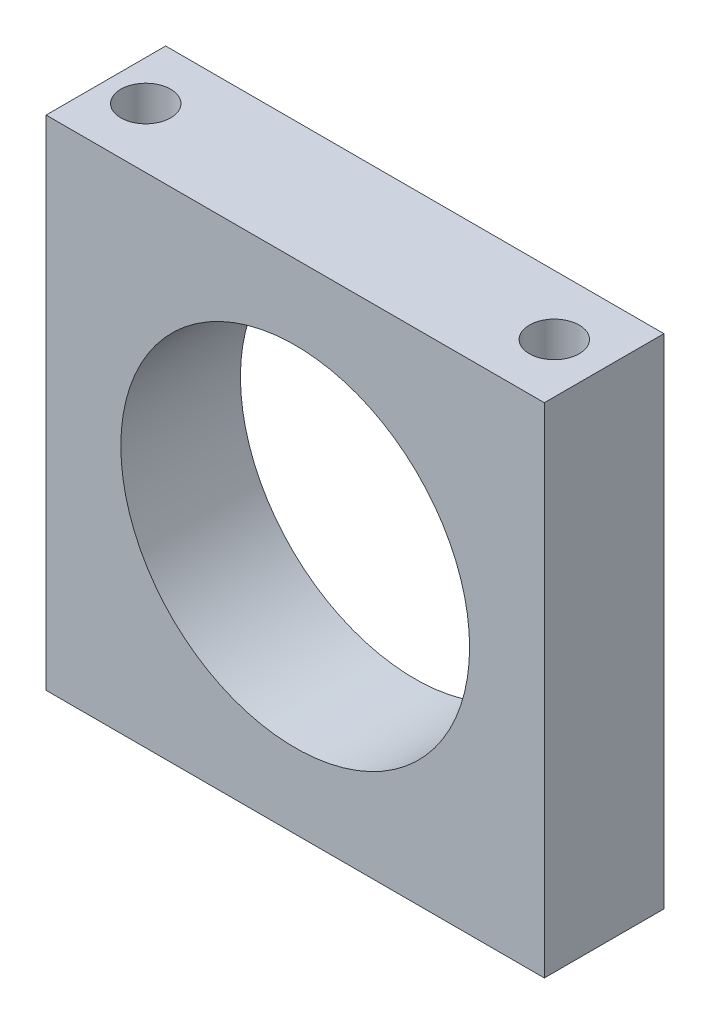
ISO-10303-21;
HEADER;
FILE_DESCRIPTION(('STEP AP214'),'2;1');
FILE_NAME('part.step','',(''),(''),'','','');
FILE_SCHEMA(('AUTOMOTIVE_DESIGN { 1 0 10303 214 1 1 1 1 }'));
ENDSEC;
DATA;
#1=APPLICATION_CONTEXT('core data for automotive mechanical design processes');
#2=APPLICATION_PROTOCOL_DEFINITION('international standard','automotive_design',2000,#1);
#3=PRODUCT_CONTEXT('',#1,'mechanical');
#4=PRODUCT('Part','Part','',(#3));
#5=PRODUCT_RELATED_PRODUCT_CATEGORY('part','',(#4));
#6=PRODUCT_DEFINITION_FORMATION('','',#4);
#7=PRODUCT_DEFINITION_CONTEXT('part definition',#1,'design');
#8=PRODUCT_DEFINITION('design','',#6,#7);
#9=PRODUCT_DEFINITION_SHAPE('','',#8);
#10=(LENGTH_UNIT() NAMED_UNIT(*) SI_UNIT(.MILLI.,.METRE.));
#11=(NAMED_UNIT(*) PLANE_ANGLE_UNIT() SI_UNIT($,.RADIAN.));
#12=(NAMED_UNIT(*) SI_UNIT($,.STERADIAN.) SOLID_ANGLE_UNIT());
#13=UNCERTAINTY_MEASURE_WITH_UNIT(LENGTH_MEASURE(1.E-05),#10,'distance_accuracy_value','');
#14=(GEOMETRIC_REPRESENTATION_CONTEXT(3) GLOBAL_UNCERTAINTY_ASSIGNED_CONTEXT((#13)) GLOBAL_UNIT_ASSIGNED_CONTEXT((#10,
#11,#12)) REPRESENTATION_CONTEXT('',''));
#15=CARTESIAN_POINT('',(0.,0.,0.));
#16=DIRECTION('',(0.,0.,1.));
#17=DIRECTION('',(1.,0.,0.));
#18=AXIS2_PLACEMENT_3D('',#15,#16,#17);
#19=CARTESIAN_POINT('',(0.,0.,12.));
#20=DIRECTION('',(0.,0.,-1.));
#21=DIRECTION('',(-1.,0.,0.));
#22=AXIS2_PLACEMENT_3D('',#19,#20,#21);
#23=PLANE('',#22);
#24=DIRECTION('',(0.,1.,0.));
#25=VECTOR('',#24,1.);
#26=CARTESIAN_POINT('',(25.,-25.,12.));
#27=LINE('',#26,#25);
#28=CARTESIAN_POINT('',(25.,-25.,12.));
#29=VERTEX_POINT('',#28);
#30=CARTESIAN_POINT('',(25.,25.,12.));
#31=VERTEX_POINT('',#30);
#32=EDGE_CURVE('E85',#29,#31,#27,.T.);
#33=ORIENTED_EDGE('',*,*,#32,.T.);
#34=DIRECTION('',(-1.,0.,0.));
#35=VECTOR('',#34,1.);
#36=CARTESIAN_POINT('',(-25.,25.,12.));
#37=LINE('',#36,#35);
#38=CARTESIAN_POINT('',(-25.,25.,12.));
#39=VERTEX_POINT('',#38);
#40=EDGE_CURVE('E80',#31,#39,#37,.T.);
#41=ORIENTED_EDGE('',*,*,#40,.T.);
#42=DIRECTION('',(0.,-1.,0.));
#43=VECTOR('',#42,1.);
#44=CARTESIAN_POINT('',(-25.,-25.,12.));
#45=LINE('',#44,#43);
#46=CARTESIAN_POINT('',(-25.,-25.,12.));
#47=VERTEX_POINT('',#46);
#48=EDGE_CURVE('E83',#39,#47,#45,.T.);
#49=ORIENTED_EDGE('',*,*,#48,.T.);
#50=DIRECTION('',(1.,0.,0.));
#51=VECTOR('',#50,1.);
#52=CARTESIAN_POINT('',(-25.,-25.,12.));
#53=LINE('',#52,#51);
#54=EDGE_CURVE('E50',#47,#29,#53,.T.);
#55=ORIENTED_EDGE('',*,*,#54,.T.);
#56=EDGE_LOOP('',(#33,#41,#49,#55));
#57=FACE_BOUND('',#56,.T.);
#58=CARTESIAN_POINT('',(0.,0.,12.));
#59=DIRECTION('',(0.,0.,1.));
#60=DIRECTION('',(1.,0.,0.));
#61=AXIS2_PLACEMENT_3D('',#58,#59,#60);
#62=CIRCLE('',#61,17.5);
#63=CARTESIAN_POINT('',(17.5,0.,12.));
#64=VERTEX_POINT('',#63);
#65=EDGE_CURVE('E100',#64,#64,#62,.T.);
#66=ORIENTED_EDGE('',*,*,#65,.F.);
#67=EDGE_LOOP('',(#66));
#68=FACE_BOUND('',#67,.T.);
#69=ADVANCED_FACE('F33',(#57,#68),#23,.F.);
#70=CARTESIAN_POINT('',(0.,0.,0.));
#71=DIRECTION('',(0.,0.,-1.));
#72=DIRECTION('',(-1.,0.,0.));
#73=AXIS2_PLACEMENT_3D('',#70,#71,#72);
#74=PLANE('',#73);
#75=DIRECTION('',(0.,1.,0.));
#76=VECTOR('',#75,1.);
#77=CARTESIAN_POINT('',(25.,-25.,0.));
#78=LINE('',#77,#76);
#79=CARTESIAN_POINT('',(25.,-25.,0.));
#80=VERTEX_POINT('',#79);
#81=CARTESIAN_POINT('',(25.,25.,0.));
#82=VERTEX_POINT('',#81);
#83=EDGE_CURVE('E97',#80,#82,#78,.T.);
#84=ORIENTED_EDGE('',*,*,#83,.F.);
#85=DIRECTION('',(1.,0.,0.));
#86=VECTOR('',#85,1.);
#87=CARTESIAN_POINT('',(-25.,-25.,0.));
#88=LINE('',#87,#86);
#89=CARTESIAN_POINT('',(-25.,-25.,0.));
#90=VERTEX_POINT('',#89);
#91=EDGE_CURVE('E73',#90,#80,#88,.T.);
#92=ORIENTED_EDGE('',*,*,#91,.F.);
#93=DIRECTION('',(0.,-1.,0.));
#94=VECTOR('',#93,1.);
#95=CARTESIAN_POINT('',(-25.,-25.,0.));
#96=LINE('',#95,#94);
#97=CARTESIAN_POINT('',(-25.,25.,0.));
#98=VERTEX_POINT('',#97);
#99=EDGE_CURVE('E67',#98,#90,#96,.T.);
#100=ORIENTED_EDGE('',*,*,#99,.F.);
#101=DIRECTION('',(-1.,0.,0.));
#102=VECTOR('',#101,1.);
#103=CARTESIAN_POINT('',(-25.,25.,0.));
#104=LINE('',#103,#102);
#105=EDGE_CURVE('E89',#82,#98,#104,.T.);
#106=ORIENTED_EDGE('',*,*,#105,.F.);
#107=EDGE_LOOP('',(#84,#92,#100,#106));
#108=FACE_BOUND('',#107,.T.);
#109=CARTESIAN_POINT('',(0.,0.,0.));
#110=DIRECTION('',(0.,0.,1.));
#111=DIRECTION('',(1.,0.,0.));
#112=AXIS2_PLACEMENT_3D('',#109,#110,#111);
#113=CIRCLE('',#112,17.5);
#114=CARTESIAN_POINT('',(17.5,0.,0.));
#115=VERTEX_POINT('',#114);
#116=EDGE_CURVE('E112',#115,#115,#113,.T.);
#117=ORIENTED_EDGE('',*,*,#116,.T.);
#118=EDGE_LOOP('',(#117));
#119=FACE_BOUND('',#118,.T.);
#120=ADVANCED_FACE('F108',(#108,#119),#74,.T.);
#121=CARTESIAN_POINT('',(25.,-25.,12.));
#122=DIRECTION('',(-1.,0.,0.));
#123=DIRECTION('',(0.,0.,1.));
#124=AXIS2_PLACEMENT_3D('',#121,#122,#123);
#125=PLANE('',#124);
#126=ORIENTED_EDGE('',*,*,#83,.T.);
#127=DIRECTION('',(0.,0.,-1.));
#128=VECTOR('',#127,1.);
#129=CARTESIAN_POINT('',(25.,25.,12.));
#130=LINE('',#129,#128);
#131=EDGE_CURVE('E11',#31,#82,#130,.T.);
#132=ORIENTED_EDGE('',*,*,#131,.F.);
#133=ORIENTED_EDGE('',*,*,#32,.F.);
#134=DIRECTION('',(0.,0.,-1.));
#135=VECTOR('',#134,1.);
#136=CARTESIAN_POINT('',(25.,-25.,12.));
#137=LINE('',#136,#135);
#138=EDGE_CURVE('E93',#29,#80,#137,.T.);
#139=ORIENTED_EDGE('',*,*,#138,.T.);
#140=EDGE_LOOP('',(#126,#132,#133,#139));
#141=FACE_BOUND('',#140,.T.);
#142=ADVANCED_FACE('F35',(#141),#125,.F.);
#143=CARTESIAN_POINT('',(-25.,25.,12.));
#144=DIRECTION('',(0.,-1.,0.));
#145=DIRECTION('',(0.,0.,-1.));
#146=AXIS2_PLACEMENT_3D('',#143,#144,#145);
#147=PLANE('',#146);
#148=CARTESIAN_POINT('',(-21.,25.,6.));
#149=DIRECTION('',(0.,1.,0.));
#150=DIRECTION('',(0.,0.,1.));
#151=AXIS2_PLACEMENT_3D('',#148,#149,#150);
#152=CIRCLE('',#151,2.5);
#153=CARTESIAN_POINT('',(-21.,25.,8.5));
#154=VERTEX_POINT('',#153);
#155=EDGE_CURVE('E136',#154,#154,#152,.T.);
#156=ORIENTED_EDGE('',*,*,#155,.F.);
#157=EDGE_LOOP('',(#156));
#158=FACE_BOUND('',#157,.T.);
#159=CARTESIAN_POINT('',(20.,25.,6.));
#160=DIRECTION('',(0.,1.,0.));
#161=DIRECTION('',(0.,0.,1.));
#162=AXIS2_PLACEMENT_3D('',#159,#160,#161);
#163=CIRCLE('',#162,2.5);
#164=CARTESIAN_POINT('',(20.,25.,8.5));
#165=VERTEX_POINT('',#164);
#166=EDGE_CURVE('E130',#165,#165,#163,.T.);
#167=ORIENTED_EDGE('',*,*,#166,.F.);
#168=EDGE_LOOP('',(#167));
#169=FACE_BOUND('',#168,.T.);
#170=ORIENTED_EDGE('',*,*,#105,.T.);
#171=DIRECTION('',(0.,0.,-1.));
#172=VECTOR('',#171,1.);
#173=CARTESIAN_POINT('',(-25.,25.,12.));
#174=LINE('',#173,#172);
#175=EDGE_CURVE('E42',#39,#98,#174,.T.);
#176=ORIENTED_EDGE('',*,*,#175,.F.);
#177=ORIENTED_EDGE('',*,*,#40,.F.);
#178=ORIENTED_EDGE('',*,*,#131,.T.);
#179=EDGE_LOOP('',(#170,#176,#177,#178));
#180=FACE_BOUND('',#179,.T.);
#181=ADVANCED_FACE('F88',(#158,#169,#180),#147,.F.);
#182=CARTESIAN_POINT('',(-25.,-25.,12.));
#183=DIRECTION('',(1.,0.,0.));
#184=DIRECTION('',(0.,0.,-1.));
#185=AXIS2_PLACEMENT_3D('',#182,#183,#184);
#186=PLANE('',#185);
#187=ORIENTED_EDGE('',*,*,#99,.T.);
#188=DIRECTION('',(0.,0.,-1.));
#189=VECTOR('',#188,1.);
#190=CARTESIAN_POINT('',(-25.,-25.,12.));
#191=LINE('',#190,#189);
#192=EDGE_CURVE('E90',#47,#90,#191,.T.);
#193=ORIENTED_EDGE('',*,*,#192,.F.);
#194=ORIENTED_EDGE('',*,*,#48,.F.);
#195=ORIENTED_EDGE('',*,*,#175,.T.);
#196=EDGE_LOOP('',(#187,#193,#194,#195));
#197=FACE_BOUND('',#196,.T.);
#198=ADVANCED_FACE('F91',(#197),#186,.F.);
#199=CARTESIAN_POINT('',(-25.,-25.,12.));
#200=DIRECTION('',(0.,1.,0.));
#201=DIRECTION('',(0.,0.,1.));
#202=AXIS2_PLACEMENT_3D('',#199,#200,#201);
#203=PLANE('',#202);
#204=CARTESIAN_POINT('',(20.,-25.,6.));
#205=DIRECTION('',(0.,-1.,0.));
#206=DIRECTION('',(0.,0.,-1.));
#207=AXIS2_PLACEMENT_3D('',#204,#205,#206);
#208=CIRCLE('',#207,2.5);
#209=CARTESIAN_POINT('',(20.,-25.,3.5));
#210=VERTEX_POINT('',#209);
#211=EDGE_CURVE('E124',#210,#210,#208,.T.);
#212=ORIENTED_EDGE('',*,*,#211,.F.);
#213=EDGE_LOOP('',(#212));
#214=FACE_BOUND('',#213,.T.);
#215=CARTESIAN_POINT('',(-21.,-25.,6.));
#216=DIRECTION('',(0.,-1.,0.));
#217=DIRECTION('',(0.,0.,-1.));
#218=AXIS2_PLACEMENT_3D('',#215,#216,#217);
#219=CIRCLE('',#218,2.5);
#220=CARTESIAN_POINT('',(-21.,-25.,3.5));
#221=VERTEX_POINT('',#220);
#222=EDGE_CURVE('E118',#221,#221,#219,.T.);
#223=ORIENTED_EDGE('',*,*,#222,.F.);
#224=EDGE_LOOP('',(#223));
#225=FACE_BOUND('',#224,.T.);
#226=ORIENTED_EDGE('',*,*,#91,.T.);
#227=ORIENTED_EDGE('',*,*,#138,.F.);
#228=ORIENTED_EDGE('',*,*,#54,.F.);
#229=ORIENTED_EDGE('',*,*,#192,.T.);
#230=EDGE_LOOP('',(#226,#227,#228,#229));
#231=FACE_BOUND('',#230,.T.);
#232=ADVANCED_FACE('F105',(#214,#225,#231),#203,.F.);
#233=CARTESIAN_POINT('',(0.,0.,12.));
#234=DIRECTION('',(0.,0.,-1.));
#235=DIRECTION('',(-1.,0.,0.));
#236=AXIS2_PLACEMENT_3D('',#233,#234,#235);
#237=CYLINDRICAL_SURFACE('',#236,17.5);
#238=ORIENTED_EDGE('',*,*,#65,.T.);
#239=EDGE_LOOP('',(#238));
#240=FACE_BOUND('',#239,.T.);
#241=ORIENTED_EDGE('',*,*,#116,.F.);
#242=EDGE_LOOP('',(#241));
#243=FACE_BOUND('',#242,.T.);
#244=ADVANCED_FACE('F177',(#240,#243),#237,.F.);
#245=CARTESIAN_POINT('',(-21.,-20.,6.));
#246=DIRECTION('',(0.,-1.,0.));
#247=DIRECTION('',(0.,0.,-1.));
#248=AXIS2_PLACEMENT_3D('',#245,#246,#247);
#249=CYLINDRICAL_SURFACE('',#248,2.5);
#250=CARTESIAN_POINT('',(-21.,-20.,6.));
#251=DIRECTION('',(0.,-1.,0.));
#252=DIRECTION('',(0.,0.,-1.));
#253=AXIS2_PLACEMENT_3D('',#250,#251,#252);
#254=CIRCLE('',#253,2.5);
#255=CARTESIAN_POINT('',(-21.,-20.,3.5));
#256=VERTEX_POINT('',#255);
#257=EDGE_CURVE('E115',#256,#256,#254,.T.);
#258=ORIENTED_EDGE('',*,*,#257,.F.);
#259=EDGE_LOOP('',(#258));
#260=FACE_BOUND('',#259,.T.);
#261=ORIENTED_EDGE('',*,*,#222,.T.);
#262=EDGE_LOOP('',(#261));
#263=FACE_BOUND('',#262,.T.);
#264=ADVANCED_FACE('F201',(#260,#263),#249,.F.);
#265=CARTESIAN_POINT('',(-21.,-20.,6.));
#266=DIRECTION('',(0.,-1.,0.));
#267=DIRECTION('',(0.,0.,-1.));
#268=AXIS2_PLACEMENT_3D('',#265,#266,#267);
#269=PLANE('',#268);
#270=ORIENTED_EDGE('',*,*,#257,.T.);
#271=EDGE_LOOP('',(#270));
#272=FACE_BOUND('',#271,.T.);
#273=ADVANCED_FACE('F207',(#272),#269,.T.);
#274=CARTESIAN_POINT('',(20.,-20.,6.));
#275=DIRECTION('',(0.,-1.,0.));
#276=DIRECTION('',(0.,0.,-1.));
#277=AXIS2_PLACEMENT_3D('',#274,#275,#276);
#278=CYLINDRICAL_SURFACE('',#277,2.5);
#279=CARTESIAN_POINT('',(20.,-20.,6.));
#280=DIRECTION('',(0.,-1.,0.));
#281=DIRECTION('',(0.,0.,-1.));
#282=AXIS2_PLACEMENT_3D('',#279,#280,#281);
#283=CIRCLE('',#282,2.5);
#284=CARTESIAN_POINT('',(20.,-20.,3.5));
#285=VERTEX_POINT('',#284);
#286=EDGE_CURVE('E121',#285,#285,#283,.T.);
#287=ORIENTED_EDGE('',*,*,#286,.F.);
#288=EDGE_LOOP('',(#287));
#289=FACE_BOUND('',#288,.T.);
#290=ORIENTED_EDGE('',*,*,#211,.T.);
#291=EDGE_LOOP('',(#290));
#292=FACE_BOUND('',#291,.T.);
#293=ADVANCED_FACE('F166',(#289,#292),#278,.F.);
#294=CARTESIAN_POINT('',(20.,-20.,6.));
#295=DIRECTION('',(0.,-1.,0.));
#296=DIRECTION('',(0.,0.,-1.));
#297=AXIS2_PLACEMENT_3D('',#294,#295,#296);
#298=PLANE('',#297);
#299=ORIENTED_EDGE('',*,*,#286,.T.);
#300=EDGE_LOOP('',(#299));
#301=FACE_BOUND('',#300,.T.);
#302=ADVANCED_FACE('F157',(#301),#298,.T.);
#303=CARTESIAN_POINT('',(20.,20.,6.));
#304=DIRECTION('',(0.,1.,0.));
#305=DIRECTION('',(0.,0.,1.));
#306=AXIS2_PLACEMENT_3D('',#303,#304,#305);
#307=CYLINDRICAL_SURFACE('',#306,2.5);
#308=CARTESIAN_POINT('',(20.,20.,6.));
#309=DIRECTION('',(0.,1.,0.));
#310=DIRECTION('',(0.,0.,1.));
#311=AXIS2_PLACEMENT_3D('',#308,#309,#310);
#312=CIRCLE('',#311,2.5);
#313=CARTESIAN_POINT('',(20.,20.,8.5));
#314=VERTEX_POINT('',#313);
#315=EDGE_CURVE('E127',#314,#314,#312,.T.);
#316=ORIENTED_EDGE('',*,*,#315,.F.);
#317=EDGE_LOOP('',(#316));
#318=FACE_BOUND('',#317,.T.);
#319=ORIENTED_EDGE('',*,*,#166,.T.);
#320=EDGE_LOOP('',(#319));
#321=FACE_BOUND('',#320,.T.);
#322=ADVANCED_FACE('F155',(#318,#321),#307,.F.);
#323=CARTESIAN_POINT('',(20.,20.,6.));
#324=DIRECTION('',(0.,1.,0.));
#325=DIRECTION('',(0.,0.,1.));
#326=AXIS2_PLACEMENT_3D('',#323,#324,#325);
#327=PLANE('',#326);
#328=ORIENTED_EDGE('',*,*,#315,.T.);
#329=EDGE_LOOP('',(#328));
#330=FACE_BOUND('',#329,.T.);
#331=ADVANCED_FACE('F147',(#330),#327,.T.);
#332=CARTESIAN_POINT('',(-21.,20.,6.));
#333=DIRECTION('',(0.,1.,0.));
#334=DIRECTION('',(0.,0.,1.));
#335=AXIS2_PLACEMENT_3D('',#332,#333,#334);
#336=CYLINDRICAL_SURFACE('',#335,2.5);
#337=CARTESIAN_POINT('',(-21.,20.,6.));
#338=DIRECTION('',(0.,1.,0.));
#339=DIRECTION('',(0.,0.,1.));
#340=AXIS2_PLACEMENT_3D('',#337,#338,#339);
#341=CIRCLE('',#340,2.5);
#342=CARTESIAN_POINT('',(-21.,20.,8.5));
#343=VERTEX_POINT('',#342);
#344=EDGE_CURVE('E133',#343,#343,#341,.T.);
#345=ORIENTED_EDGE('',*,*,#344,.F.);
#346=EDGE_LOOP('',(#345));
#347=FACE_BOUND('',#346,.T.);
#348=ORIENTED_EDGE('',*,*,#155,.T.);
#349=EDGE_LOOP('',(#348));
#350=FACE_BOUND('',#349,.T.);
#351=ADVANCED_FACE('F144',(#347,#350),#336,.F.);
#352=CARTESIAN_POINT('',(-21.,20.,6.));
#353=DIRECTION('',(0.,1.,0.));
#354=DIRECTION('',(0.,0.,1.));
#355=AXIS2_PLACEMENT_3D('',#352,#353,#354);
#356=PLANE('',#355);
#357=ORIENTED_EDGE('',*,*,#344,.T.);
#358=EDGE_LOOP('',(#357));
#359=FACE_BOUND('',#358,.T.);
#360=ADVANCED_FACE('F142',(#359),#356,.T.);
#361=CLOSED_SHELL('',(#69,#120,#142,#181,#198,#232,#244,#264,#273,#293,#302,#322,#331,#351,#360));
#362=MANIFOLD_SOLID_BREP('B2',#361);
#363=ADVANCED_BREP_SHAPE_REPRESENTATION('',(#18,#362),#14);
#364=SHAPE_DEFINITION_REPRESENTATION(#9,#363);
ENDSEC;
END-ISO-10303-21;
